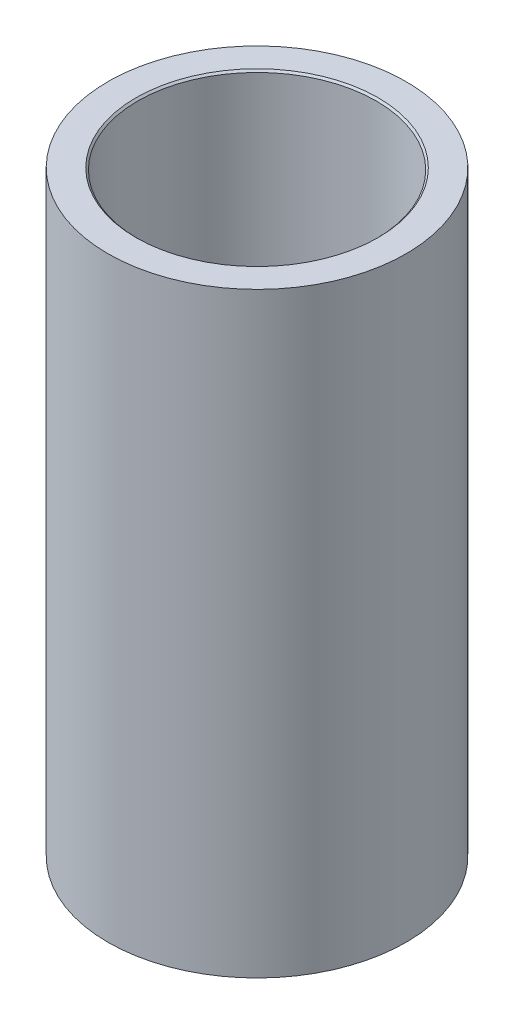
ISO-10303-21;
HEADER;
FILE_DESCRIPTION(('STEP AP214'),'2;1');
FILE_NAME('part.step','',(''),(''),'','','');
FILE_SCHEMA(('AUTOMOTIVE_DESIGN { 1 0 10303 214 1 1 1 1 }'));
ENDSEC;
DATA;
#1=APPLICATION_CONTEXT('core data for automotive mechanical design processes');
#2=APPLICATION_PROTOCOL_DEFINITION('international standard','automotive_design',2000,#1);
#3=PRODUCT_CONTEXT('',#1,'mechanical');
#4=PRODUCT('Part','Part','',(#3));
#5=PRODUCT_RELATED_PRODUCT_CATEGORY('part','',(#4));
#6=PRODUCT_DEFINITION_FORMATION('','',#4);
#7=PRODUCT_DEFINITION_CONTEXT('part definition',#1,'design');
#8=PRODUCT_DEFINITION('design','',#6,#7);
#9=PRODUCT_DEFINITION_SHAPE('','',#8);
#10=(LENGTH_UNIT() NAMED_UNIT(*) SI_UNIT(.MILLI.,.METRE.));
#11=(NAMED_UNIT(*) PLANE_ANGLE_UNIT() SI_UNIT($,.RADIAN.));
#12=(NAMED_UNIT(*) SI_UNIT($,.STERADIAN.) SOLID_ANGLE_UNIT());
#13=UNCERTAINTY_MEASURE_WITH_UNIT(LENGTH_MEASURE(1.E-05),#10,'distance_accuracy_value','');
#14=(GEOMETRIC_REPRESENTATION_CONTEXT(3) GLOBAL_UNCERTAINTY_ASSIGNED_CONTEXT((#13)) GLOBAL_UNIT_ASSIGNED_CONTEXT((#10,
#11,#12)) REPRESENTATION_CONTEXT('',''));
#15=CARTESIAN_POINT('',(0.,0.,0.));
#16=DIRECTION('',(0.,0.,1.));
#17=DIRECTION('',(1.,0.,0.));
#18=AXIS2_PLACEMENT_3D('',#15,#16,#17);
#19=CARTESIAN_POINT('',(0.,8.,0.));
#20=DIRECTION('',(0.,-1.,0.));
#21=DIRECTION('',(0.,0.,-1.));
#22=AXIS2_PLACEMENT_3D('',#19,#20,#21);
#23=CYLINDRICAL_SURFACE('',#22,2.);
#24=CARTESIAN_POINT('',(0.,8.,0.));
#25=DIRECTION('',(0.,1.,0.));
#26=DIRECTION('',(0.,0.,1.));
#27=AXIS2_PLACEMENT_3D('',#24,#25,#26);
#28=CIRCLE('',#27,2.);
#29=CARTESIAN_POINT('',(0.,8.,2.));
#30=VERTEX_POINT('',#29);
#31=EDGE_CURVE('E10',#30,#30,#28,.T.);
#32=ORIENTED_EDGE('',*,*,#31,.F.);
#33=EDGE_LOOP('',(#32));
#34=FACE_BOUND('',#33,.T.);
#35=CARTESIAN_POINT('',(0.,0.,0.));
#36=DIRECTION('',(0.,1.,0.));
#37=DIRECTION('',(0.,0.,1.));
#38=AXIS2_PLACEMENT_3D('',#35,#36,#37);
#39=CIRCLE('',#38,2.);
#40=CARTESIAN_POINT('',(0.,0.,2.));
#41=VERTEX_POINT('',#40);
#42=EDGE_CURVE('E40',#41,#41,#39,.T.);
#43=ORIENTED_EDGE('',*,*,#42,.T.);
#44=EDGE_LOOP('',(#43));
#45=FACE_BOUND('',#44,.T.);
#46=ADVANCED_FACE('F37',(#34,#45),#23,.T.);
#47=CARTESIAN_POINT('',(0.,8.,0.));
#48=DIRECTION('',(0.,1.,0.));
#49=DIRECTION('',(0.,0.,1.));
#50=AXIS2_PLACEMENT_3D('',#47,#48,#49);
#51=PLANE('',#50);
#52=CARTESIAN_POINT('',(0.,8.,0.));
#53=DIRECTION('',(0.,1.,0.));
#54=DIRECTION('',(0.,0.,1.));
#55=AXIS2_PLACEMENT_3D('',#52,#53,#54);
#56=CIRCLE('',#55,1.625);
#57=CARTESIAN_POINT('',(0.,8.,1.625));
#58=VERTEX_POINT('',#57);
#59=EDGE_CURVE('E54',#58,#58,#56,.T.);
#60=ORIENTED_EDGE('',*,*,#59,.F.);
#61=EDGE_LOOP('',(#60));
#62=FACE_BOUND('',#61,.T.);
#63=ORIENTED_EDGE('',*,*,#31,.T.);
#64=EDGE_LOOP('',(#63));
#65=FACE_BOUND('',#64,.T.);
#66=ADVANCED_FACE('F60',(#62,#65),#51,.T.);
#67=CARTESIAN_POINT('',(0.,0.,0.));
#68=DIRECTION('',(0.,1.,0.));
#69=DIRECTION('',(0.,0.,1.));
#70=AXIS2_PLACEMENT_3D('',#67,#68,#69);
#71=PLANE('',#70);
#72=CARTESIAN_POINT('',(0.,0.,0.));
#73=DIRECTION('',(0.,1.,0.));
#74=DIRECTION('',(0.,0.,1.));
#75=AXIS2_PLACEMENT_3D('',#72,#73,#74);
#76=CIRCLE('',#75,1.6);
#77=CARTESIAN_POINT('',(0.,0.,1.6));
#78=VERTEX_POINT('',#77);
#79=EDGE_CURVE('E47',#78,#78,#76,.T.);
#80=ORIENTED_EDGE('',*,*,#79,.T.);
#81=EDGE_LOOP('',(#80));
#82=FACE_BOUND('',#81,.T.);
#83=ORIENTED_EDGE('',*,*,#42,.F.);
#84=EDGE_LOOP('',(#83));
#85=FACE_BOUND('',#84,.T.);
#86=ADVANCED_FACE('F62',(#82,#85),#71,.F.);
#87=CARTESIAN_POINT('',(0.,8.,0.));
#88=DIRECTION('',(0.,1.,0.));
#89=DIRECTION('',(0.,0.,1.));
#90=AXIS2_PLACEMENT_3D('',#87,#88,#89);
#91=CYLINDRICAL_SURFACE('',#90,1.6);
#92=ORIENTED_EDGE('',*,*,#79,.F.);
#93=EDGE_LOOP('',(#92));
#94=FACE_BOUND('',#93,.T.);
#95=CARTESIAN_POINT('',(0.,7.975,0.));
#96=DIRECTION('',(0.,1.,0.));
#97=DIRECTION('',(0.,0.,1.));
#98=AXIS2_PLACEMENT_3D('',#95,#96,#97);
#99=CIRCLE('',#98,1.6);
#100=CARTESIAN_POINT('',(0.,7.975,1.6));
#101=VERTEX_POINT('',#100);
#102=EDGE_CURVE('E51',#101,#101,#99,.T.);
#103=ORIENTED_EDGE('',*,*,#102,.T.);
#104=EDGE_LOOP('',(#103));
#105=FACE_BOUND('',#104,.T.);
#106=ADVANCED_FACE('F68',(#94,#105),#91,.F.);
#107=CARTESIAN_POINT('',(0.,8.,0.));
#108=DIRECTION('',(0.,1.,0.));
#109=DIRECTION('',(0.,0.,1.));
#110=AXIS2_PLACEMENT_3D('',#107,#108,#109);
#111=CONICAL_SURFACE('',#110,1.625,0.785398163397435);
#112=ORIENTED_EDGE('',*,*,#102,.F.);
#113=EDGE_LOOP('',(#112));
#114=FACE_BOUND('',#113,.T.);
#115=ORIENTED_EDGE('',*,*,#59,.T.);
#116=EDGE_LOOP('',(#115));
#117=FACE_BOUND('',#116,.T.);
#118=ADVANCED_FACE('F58',(#114,#117),#111,.F.);
#119=CLOSED_SHELL('',(#46,#66,#86,#106,#118));
#120=MANIFOLD_SOLID_BREP('B2',#119);
#121=ADVANCED_BREP_SHAPE_REPRESENTATION('',(#18,#120),#14);
#122=SHAPE_DEFINITION_REPRESENTATION(#9,#121);
ENDSEC;
END-ISO-10303-21;
